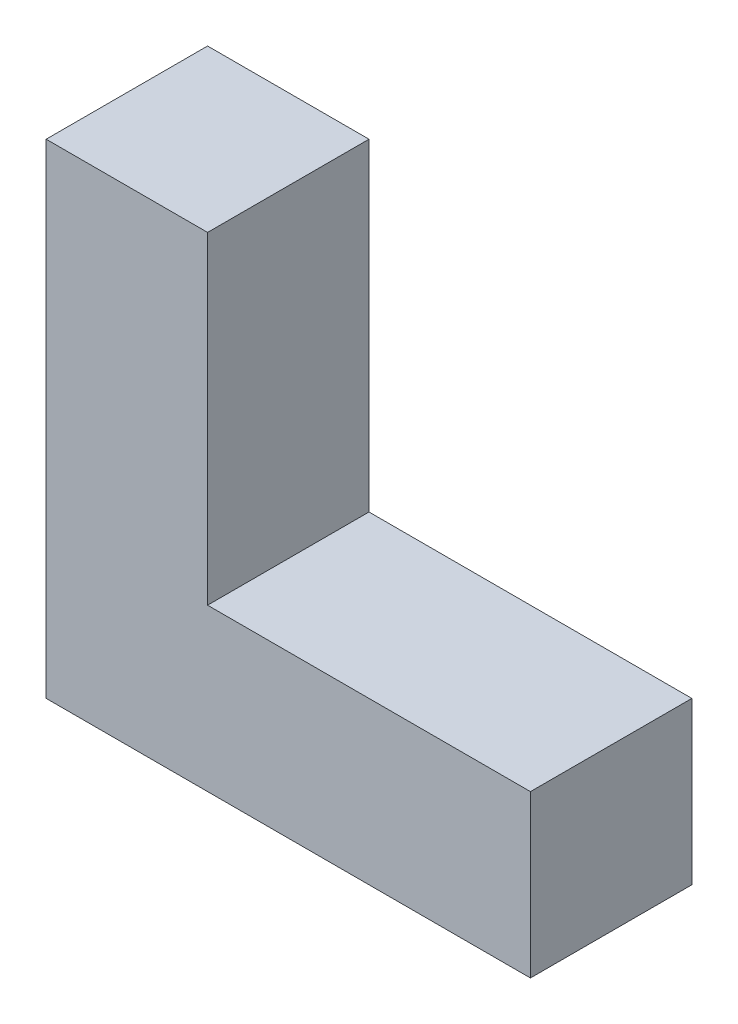
ISO-10303-21;
HEADER;
FILE_DESCRIPTION(('STEP AP214'),'2;1');
FILE_NAME('part.step','',(''),(''),'','','');
FILE_SCHEMA(('AUTOMOTIVE_DESIGN { 1 0 10303 214 1 1 1 1 }'));
ENDSEC;
DATA;
#1=APPLICATION_CONTEXT('core data for automotive mechanical design processes');
#2=APPLICATION_PROTOCOL_DEFINITION('international standard','automotive_design',2000,#1);
#3=PRODUCT_CONTEXT('',#1,'mechanical');
#4=PRODUCT('Part','Part','',(#3));
#5=PRODUCT_RELATED_PRODUCT_CATEGORY('part','',(#4));
#6=PRODUCT_DEFINITION_FORMATION('','',#4);
#7=PRODUCT_DEFINITION_CONTEXT('part definition',#1,'design');
#8=PRODUCT_DEFINITION('design','',#6,#7);
#9=PRODUCT_DEFINITION_SHAPE('','',#8);
#10=(LENGTH_UNIT() NAMED_UNIT(*) SI_UNIT(.MILLI.,.METRE.));
#11=(NAMED_UNIT(*) PLANE_ANGLE_UNIT() SI_UNIT($,.RADIAN.));
#12=(NAMED_UNIT(*) SI_UNIT($,.STERADIAN.) SOLID_ANGLE_UNIT());
#13=UNCERTAINTY_MEASURE_WITH_UNIT(LENGTH_MEASURE(1.E-05),#10,'distance_accuracy_value','');
#14=(GEOMETRIC_REPRESENTATION_CONTEXT(3) GLOBAL_UNCERTAINTY_ASSIGNED_CONTEXT((#13)) GLOBAL_UNIT_ASSIGNED_CONTEXT((#10,
#11,#12)) REPRESENTATION_CONTEXT('',''));
#15=CARTESIAN_POINT('',(0.,0.,0.));
#16=DIRECTION('',(0.,0.,1.));
#17=DIRECTION('',(1.,0.,0.));
#18=AXIS2_PLACEMENT_3D('',#15,#16,#17);
#19=CARTESIAN_POINT('',(0.,0.,25.4));
#20=DIRECTION('',(0.,1.,0.));
#21=DIRECTION('',(0.,0.,1.));
#22=AXIS2_PLACEMENT_3D('',#19,#20,#21);
#23=PLANE('',#22);
#24=DIRECTION('',(1.,0.,0.));
#25=VECTOR('',#24,1.);
#26=CARTESIAN_POINT('',(0.,0.,0.));
#27=LINE('',#26,#25);
#28=CARTESIAN_POINT('',(0.,0.,0.));
#29=VERTEX_POINT('',#28);
#30=CARTESIAN_POINT('',(76.2,0.,0.));
#31=VERTEX_POINT('',#30);
#32=EDGE_CURVE('E116',#29,#31,#27,.T.);
#33=ORIENTED_EDGE('',*,*,#32,.T.);
#34=DIRECTION('',(0.,0.,-1.));
#35=VECTOR('',#34,1.);
#36=CARTESIAN_POINT('',(76.2,0.,25.4));
#37=LINE('',#36,#35);
#38=CARTESIAN_POINT('',(76.2,0.,25.4));
#39=VERTEX_POINT('',#38);
#40=EDGE_CURVE('E11',#39,#31,#37,.T.);
#41=ORIENTED_EDGE('',*,*,#40,.F.);
#42=DIRECTION('',(1.,0.,0.));
#43=VECTOR('',#42,1.);
#44=CARTESIAN_POINT('',(0.,0.,25.4));
#45=LINE('',#44,#43);
#46=CARTESIAN_POINT('',(0.,0.,25.4));
#47=VERTEX_POINT('',#46);
#48=EDGE_CURVE('E126',#47,#39,#45,.T.);
#49=ORIENTED_EDGE('',*,*,#48,.F.);
#50=DIRECTION('',(0.,0.,-1.));
#51=VECTOR('',#50,1.);
#52=CARTESIAN_POINT('',(0.,0.,25.4));
#53=LINE('',#52,#51);
#54=EDGE_CURVE('E112',#47,#29,#53,.T.);
#55=ORIENTED_EDGE('',*,*,#54,.T.);
#56=EDGE_LOOP('',(#33,#41,#49,#55));
#57=FACE_BOUND('',#56,.T.);
#58=ADVANCED_FACE('F32',(#57),#23,.F.);
#59=CARTESIAN_POINT('',(76.2,0.,25.4));
#60=DIRECTION('',(-1.,0.,0.));
#61=DIRECTION('',(0.,0.,1.));
#62=AXIS2_PLACEMENT_3D('',#59,#60,#61);
#63=PLANE('',#62);
#64=DIRECTION('',(0.,1.,0.));
#65=VECTOR('',#64,1.);
#66=CARTESIAN_POINT('',(76.2,0.,0.));
#67=LINE('',#66,#65);
#68=CARTESIAN_POINT('',(76.2,25.4,0.));
#69=VERTEX_POINT('',#68);
#70=EDGE_CURVE('E119',#31,#69,#67,.T.);
#71=ORIENTED_EDGE('',*,*,#70,.T.);
#72=DIRECTION('',(0.,0.,-1.));
#73=VECTOR('',#72,1.);
#74=CARTESIAN_POINT('',(76.2,25.4,25.4));
#75=LINE('',#74,#73);
#76=CARTESIAN_POINT('',(76.2,25.4,25.4));
#77=VERTEX_POINT('',#76);
#78=EDGE_CURVE('E40',#77,#69,#75,.T.);
#79=ORIENTED_EDGE('',*,*,#78,.F.);
#80=DIRECTION('',(0.,1.,0.));
#81=VECTOR('',#80,1.);
#82=CARTESIAN_POINT('',(76.2,0.,25.4));
#83=LINE('',#82,#81);
#84=EDGE_CURVE('E85',#39,#77,#83,.T.);
#85=ORIENTED_EDGE('',*,*,#84,.F.);
#86=ORIENTED_EDGE('',*,*,#40,.T.);
#87=EDGE_LOOP('',(#71,#79,#85,#86));
#88=FACE_BOUND('',#87,.T.);
#89=ADVANCED_FACE('F150',(#88),#63,.F.);
#90=CARTESIAN_POINT('',(76.2,25.4,25.4));
#91=DIRECTION('',(0.,-1.,0.));
#92=DIRECTION('',(0.,0.,-1.));
#93=AXIS2_PLACEMENT_3D('',#90,#91,#92);
#94=PLANE('',#93);
#95=DIRECTION('',(-1.,0.,0.));
#96=VECTOR('',#95,1.);
#97=CARTESIAN_POINT('',(76.2,25.4,0.));
#98=LINE('',#97,#96);
#99=CARTESIAN_POINT('',(25.4,25.4,0.));
#100=VERTEX_POINT('',#99);
#101=EDGE_CURVE('E121',#69,#100,#98,.T.);
#102=ORIENTED_EDGE('',*,*,#101,.T.);
#103=DIRECTION('',(0.,0.,-1.));
#104=VECTOR('',#103,1.);
#105=CARTESIAN_POINT('',(25.4,25.4,25.4));
#106=LINE('',#105,#104);
#107=CARTESIAN_POINT('',(25.4,25.4,25.4));
#108=VERTEX_POINT('',#107);
#109=EDGE_CURVE('E107',#108,#100,#106,.T.);
#110=ORIENTED_EDGE('',*,*,#109,.F.);
#111=DIRECTION('',(-1.,0.,0.));
#112=VECTOR('',#111,1.);
#113=CARTESIAN_POINT('',(76.2,25.4,25.4));
#114=LINE('',#113,#112);
#115=EDGE_CURVE('E98',#77,#108,#114,.T.);
#116=ORIENTED_EDGE('',*,*,#115,.F.);
#117=ORIENTED_EDGE('',*,*,#78,.T.);
#118=EDGE_LOOP('',(#102,#110,#116,#117));
#119=FACE_BOUND('',#118,.T.);
#120=ADVANCED_FACE('F132',(#119),#94,.F.);
#121=CARTESIAN_POINT('',(25.4,25.4,25.4));
#122=DIRECTION('',(-1.,0.,0.));
#123=DIRECTION('',(0.,0.,1.));
#124=AXIS2_PLACEMENT_3D('',#121,#122,#123);
#125=PLANE('',#124);
#126=DIRECTION('',(0.,1.,0.));
#127=VECTOR('',#126,1.);
#128=CARTESIAN_POINT('',(25.4,25.4,0.));
#129=LINE('',#128,#127);
#130=CARTESIAN_POINT('',(25.4,76.2,0.));
#131=VERTEX_POINT('',#130);
#132=EDGE_CURVE('E106',#100,#131,#129,.T.);
#133=ORIENTED_EDGE('',*,*,#132,.T.);
#134=DIRECTION('',(0.,0.,-1.));
#135=VECTOR('',#134,1.);
#136=CARTESIAN_POINT('',(25.4,76.2,25.4));
#137=LINE('',#136,#135);
#138=CARTESIAN_POINT('',(25.4,76.2,25.4));
#139=VERTEX_POINT('',#138);
#140=EDGE_CURVE('E103',#139,#131,#137,.T.);
#141=ORIENTED_EDGE('',*,*,#140,.F.);
#142=DIRECTION('',(0.,1.,0.));
#143=VECTOR('',#142,1.);
#144=CARTESIAN_POINT('',(25.4,25.4,25.4));
#145=LINE('',#144,#143);
#146=EDGE_CURVE('E92',#108,#139,#145,.T.);
#147=ORIENTED_EDGE('',*,*,#146,.F.);
#148=ORIENTED_EDGE('',*,*,#109,.T.);
#149=EDGE_LOOP('',(#133,#141,#147,#148));
#150=FACE_BOUND('',#149,.T.);
#151=ADVANCED_FACE('F104',(#150),#125,.F.);
#152=CARTESIAN_POINT('',(25.4,76.2,25.4));
#153=DIRECTION('',(0.,-1.,0.));
#154=DIRECTION('',(0.,0.,-1.));
#155=AXIS2_PLACEMENT_3D('',#152,#153,#154);
#156=PLANE('',#155);
#157=DIRECTION('',(-1.,0.,0.));
#158=VECTOR('',#157,1.);
#159=CARTESIAN_POINT('',(25.4,76.2,0.));
#160=LINE('',#159,#158);
#161=CARTESIAN_POINT('',(0.,76.2,0.));
#162=VERTEX_POINT('',#161);
#163=EDGE_CURVE('E71',#131,#162,#160,.T.);
#164=ORIENTED_EDGE('',*,*,#163,.T.);
#165=DIRECTION('',(0.,0.,-1.));
#166=VECTOR('',#165,1.);
#167=CARTESIAN_POINT('',(0.,76.2,25.4));
#168=LINE('',#167,#166);
#169=CARTESIAN_POINT('',(0.,76.2,25.4));
#170=VERTEX_POINT('',#169);
#171=EDGE_CURVE('E108',#170,#162,#168,.T.);
#172=ORIENTED_EDGE('',*,*,#171,.F.);
#173=DIRECTION('',(-1.,0.,0.));
#174=VECTOR('',#173,1.);
#175=CARTESIAN_POINT('',(25.4,76.2,25.4));
#176=LINE('',#175,#174);
#177=EDGE_CURVE('E96',#139,#170,#176,.T.);
#178=ORIENTED_EDGE('',*,*,#177,.F.);
#179=ORIENTED_EDGE('',*,*,#140,.T.);
#180=EDGE_LOOP('',(#164,#172,#178,#179));
#181=FACE_BOUND('',#180,.T.);
#182=ADVANCED_FACE('F110',(#181),#156,.F.);
#183=CARTESIAN_POINT('',(0.,76.2,25.4));
#184=DIRECTION('',(1.,0.,0.));
#185=DIRECTION('',(0.,0.,-1.));
#186=AXIS2_PLACEMENT_3D('',#183,#184,#185);
#187=PLANE('',#186);
#188=DIRECTION('',(0.,-1.,0.));
#189=VECTOR('',#188,1.);
#190=CARTESIAN_POINT('',(0.,76.2,0.));
#191=LINE('',#190,#189);
#192=EDGE_CURVE('E77',#162,#29,#191,.T.);
#193=ORIENTED_EDGE('',*,*,#192,.T.);
#194=ORIENTED_EDGE('',*,*,#54,.F.);
#195=DIRECTION('',(0.,-1.,0.));
#196=VECTOR('',#195,1.);
#197=CARTESIAN_POINT('',(0.,76.2,25.4));
#198=LINE('',#197,#196);
#199=EDGE_CURVE('E48',#170,#47,#198,.T.);
#200=ORIENTED_EDGE('',*,*,#199,.F.);
#201=ORIENTED_EDGE('',*,*,#171,.T.);
#202=EDGE_LOOP('',(#193,#194,#200,#201));
#203=FACE_BOUND('',#202,.T.);
#204=ADVANCED_FACE('F139',(#203),#187,.F.);
#205=CARTESIAN_POINT('',(0.,0.,25.4));
#206=DIRECTION('',(0.,0.,1.));
#207=DIRECTION('',(1.,0.,0.));
#208=AXIS2_PLACEMENT_3D('',#205,#206,#207);
#209=PLANE('',#208);
#210=ORIENTED_EDGE('',*,*,#48,.T.);
#211=ORIENTED_EDGE('',*,*,#84,.T.);
#212=ORIENTED_EDGE('',*,*,#115,.T.);
#213=ORIENTED_EDGE('',*,*,#146,.T.);
#214=ORIENTED_EDGE('',*,*,#177,.T.);
#215=ORIENTED_EDGE('',*,*,#199,.T.);
#216=EDGE_LOOP('',(#210,#211,#212,#213,#214,#215));
#217=FACE_BOUND('',#216,.T.);
#218=ADVANCED_FACE('F94',(#217),#209,.T.);
#219=CARTESIAN_POINT('',(0.,0.,0.));
#220=DIRECTION('',(0.,0.,1.));
#221=DIRECTION('',(1.,0.,0.));
#222=AXIS2_PLACEMENT_3D('',#219,#220,#221);
#223=PLANE('',#222);
#224=ORIENTED_EDGE('',*,*,#32,.F.);
#225=ORIENTED_EDGE('',*,*,#192,.F.);
#226=ORIENTED_EDGE('',*,*,#163,.F.);
#227=ORIENTED_EDGE('',*,*,#132,.F.);
#228=ORIENTED_EDGE('',*,*,#101,.F.);
#229=ORIENTED_EDGE('',*,*,#70,.F.);
#230=EDGE_LOOP('',(#224,#225,#226,#227,#228,#229));
#231=FACE_BOUND('',#230,.T.);
#232=ADVANCED_FACE('F135',(#231),#223,.F.);
#233=CLOSED_SHELL('',(#58,#89,#120,#151,#182,#204,#218,#232));
#234=MANIFOLD_SOLID_BREP('B2',#233);
#235=ADVANCED_BREP_SHAPE_REPRESENTATION('',(#18,#234),#14);
#236=SHAPE_DEFINITION_REPRESENTATION(#9,#235);
ENDSEC;
END-ISO-10303-21;
